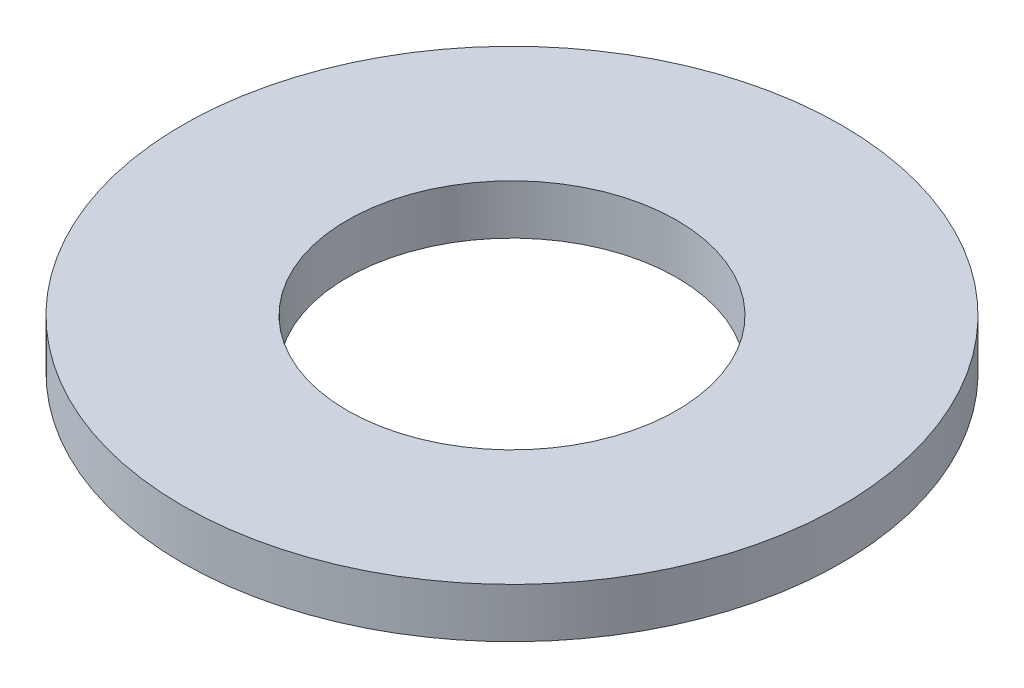
ISO-10303-21;
HEADER;
FILE_DESCRIPTION(('STEP AP214'),'2;1');
FILE_NAME('part.step','',(''),(''),'','','');
FILE_SCHEMA(('AUTOMOTIVE_DESIGN { 1 0 10303 214 1 1 1 1 }'));
ENDSEC;
DATA;
#1=APPLICATION_CONTEXT('core data for automotive mechanical design processes');
#2=APPLICATION_PROTOCOL_DEFINITION('international standard','automotive_design',2000,#1);
#3=PRODUCT_CONTEXT('',#1,'mechanical');
#4=PRODUCT('Part','Part','',(#3));
#5=PRODUCT_RELATED_PRODUCT_CATEGORY('part','',(#4));
#6=PRODUCT_DEFINITION_FORMATION('','',#4);
#7=PRODUCT_DEFINITION_CONTEXT('part definition',#1,'design');
#8=PRODUCT_DEFINITION('design','',#6,#7);
#9=PRODUCT_DEFINITION_SHAPE('','',#8);
#10=(LENGTH_UNIT() NAMED_UNIT(*) SI_UNIT(.MILLI.,.METRE.));
#11=(NAMED_UNIT(*) PLANE_ANGLE_UNIT() SI_UNIT($,.RADIAN.));
#12=(NAMED_UNIT(*) SI_UNIT($,.STERADIAN.) SOLID_ANGLE_UNIT());
#13=UNCERTAINTY_MEASURE_WITH_UNIT(LENGTH_MEASURE(1.E-05),#10,'distance_accuracy_value','');
#14=(GEOMETRIC_REPRESENTATION_CONTEXT(3) GLOBAL_UNCERTAINTY_ASSIGNED_CONTEXT((#13)) GLOBAL_UNIT_ASSIGNED_CONTEXT((#10,
#11,#12)) REPRESENTATION_CONTEXT('',''));
#15=CARTESIAN_POINT('',(0.,0.,0.));
#16=DIRECTION('',(0.,0.,1.));
#17=DIRECTION('',(1.,0.,0.));
#18=AXIS2_PLACEMENT_3D('',#15,#16,#17);
#19=CARTESIAN_POINT('',(0.,2.032,0.));
#20=DIRECTION('',(0.,-1.,0.));
#21=DIRECTION('',(0.,0.,-1.));
#22=AXIS2_PLACEMENT_3D('',#19,#20,#21);
#23=CYLINDRICAL_SURFACE('',#22,13.49375);
#24=CARTESIAN_POINT('',(0.,2.032,0.));
#25=DIRECTION('',(0.,1.,0.));
#26=DIRECTION('',(0.,0.,1.));
#27=AXIS2_PLACEMENT_3D('',#24,#25,#26);
#28=CIRCLE('',#27,13.49375);
#29=CARTESIAN_POINT('',(0.,2.032,13.49375));
#30=VERTEX_POINT('',#29);
#31=EDGE_CURVE('E10',#30,#30,#28,.T.);
#32=ORIENTED_EDGE('',*,*,#31,.F.);
#33=EDGE_LOOP('',(#32));
#34=FACE_BOUND('',#33,.T.);
#35=CARTESIAN_POINT('',(0.,0.,0.));
#36=DIRECTION('',(0.,1.,0.));
#37=DIRECTION('',(0.,0.,1.));
#38=AXIS2_PLACEMENT_3D('',#35,#36,#37);
#39=CIRCLE('',#38,13.49375);
#40=CARTESIAN_POINT('',(0.,0.,13.49375));
#41=VERTEX_POINT('',#40);
#42=EDGE_CURVE('E40',#41,#41,#39,.T.);
#43=ORIENTED_EDGE('',*,*,#42,.T.);
#44=EDGE_LOOP('',(#43));
#45=FACE_BOUND('',#44,.T.);
#46=ADVANCED_FACE('F37',(#34,#45),#23,.T.);
#47=CARTESIAN_POINT('',(0.,2.032,0.));
#48=DIRECTION('',(0.,1.,0.));
#49=DIRECTION('',(0.,0.,1.));
#50=AXIS2_PLACEMENT_3D('',#47,#48,#49);
#51=PLANE('',#50);
#52=CARTESIAN_POINT('',(0.,2.032,0.));
#53=DIRECTION('',(0.,1.,0.));
#54=DIRECTION('',(0.,0.,1.));
#55=AXIS2_PLACEMENT_3D('',#52,#53,#54);
#56=CIRCLE('',#55,6.746875);
#57=CARTESIAN_POINT('',(0.,2.032,6.746875));
#58=VERTEX_POINT('',#57);
#59=EDGE_CURVE('E49',#58,#58,#56,.T.);
#60=ORIENTED_EDGE('',*,*,#59,.F.);
#61=EDGE_LOOP('',(#60));
#62=FACE_BOUND('',#61,.T.);
#63=ORIENTED_EDGE('',*,*,#31,.T.);
#64=EDGE_LOOP('',(#63));
#65=FACE_BOUND('',#64,.T.);
#66=ADVANCED_FACE('F64',(#62,#65),#51,.T.);
#67=CARTESIAN_POINT('',(0.,0.,0.));
#68=DIRECTION('',(0.,1.,0.));
#69=DIRECTION('',(0.,0.,1.));
#70=AXIS2_PLACEMENT_3D('',#67,#68,#69);
#71=PLANE('',#70);
#72=CARTESIAN_POINT('',(0.,0.,0.));
#73=DIRECTION('',(0.,1.,0.));
#74=DIRECTION('',(0.,0.,1.));
#75=AXIS2_PLACEMENT_3D('',#72,#73,#74);
#76=CIRCLE('',#75,6.746875);
#77=CARTESIAN_POINT('',(0.,0.,6.746875));
#78=VERTEX_POINT('',#77);
#79=EDGE_CURVE('E47',#78,#78,#76,.T.);
#80=ORIENTED_EDGE('',*,*,#79,.T.);
#81=EDGE_LOOP('',(#80));
#82=FACE_BOUND('',#81,.T.);
#83=ORIENTED_EDGE('',*,*,#42,.F.);
#84=EDGE_LOOP('',(#83));
#85=FACE_BOUND('',#84,.T.);
#86=ADVANCED_FACE('F55',(#82,#85),#71,.F.);
#87=CARTESIAN_POINT('',(0.,0.,0.));
#88=DIRECTION('',(0.,1.,0.));
#89=DIRECTION('',(0.,0.,1.));
#90=AXIS2_PLACEMENT_3D('',#87,#88,#89);
#91=CYLINDRICAL_SURFACE('',#90,6.746875);
#92=ORIENTED_EDGE('',*,*,#79,.F.);
#93=EDGE_LOOP('',(#92));
#94=FACE_BOUND('',#93,.T.);
#95=ORIENTED_EDGE('',*,*,#59,.T.);
#96=EDGE_LOOP('',(#95));
#97=FACE_BOUND('',#96,.T.);
#98=ADVANCED_FACE('F58',(#94,#97),#91,.F.);
#99=CLOSED_SHELL('',(#46,#66,#86,#98));
#100=MANIFOLD_SOLID_BREP('B2',#99);
#101=ADVANCED_BREP_SHAPE_REPRESENTATION('',(#18,#100),#14);
#102=SHAPE_DEFINITION_REPRESENTATION(#9,#101);
ENDSEC;
END-ISO-10303-21;
